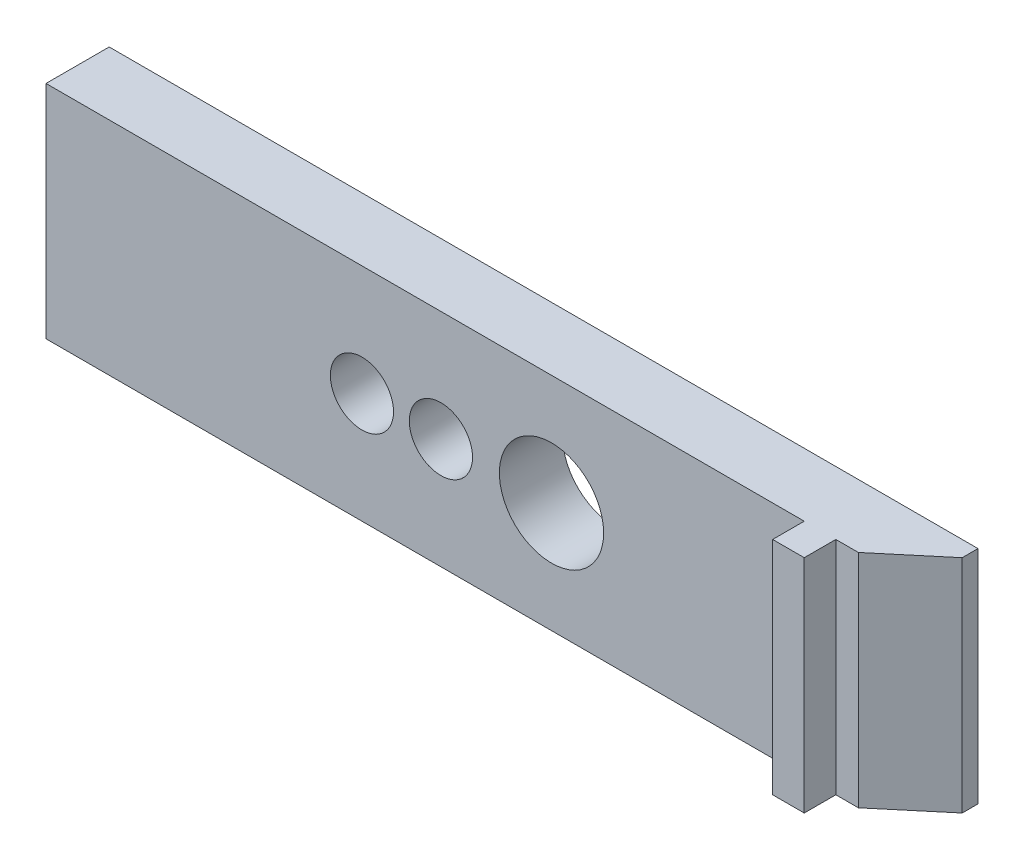
ISO-10303-21;
HEADER;
FILE_DESCRIPTION(('STEP AP214'),'2;1');
FILE_NAME('part.step','',(''),(''),'','','');
FILE_SCHEMA(('AUTOMOTIVE_DESIGN { 1 0 10303 214 1 1 1 1 }'));
ENDSEC;
DATA;
#1=APPLICATION_CONTEXT('core data for automotive mechanical design processes');
#2=APPLICATION_PROTOCOL_DEFINITION('international standard','automotive_design',2000,#1);
#3=PRODUCT_CONTEXT('',#1,'mechanical');
#4=PRODUCT('Part','Part','',(#3));
#5=PRODUCT_RELATED_PRODUCT_CATEGORY('part','',(#4));
#6=PRODUCT_DEFINITION_FORMATION('','',#4);
#7=PRODUCT_DEFINITION_CONTEXT('part definition',#1,'design');
#8=PRODUCT_DEFINITION('design','',#6,#7);
#9=PRODUCT_DEFINITION_SHAPE('','',#8);
#10=(LENGTH_UNIT() NAMED_UNIT(*) SI_UNIT(.MILLI.,.METRE.));
#11=(NAMED_UNIT(*) PLANE_ANGLE_UNIT() SI_UNIT($,.RADIAN.));
#12=(NAMED_UNIT(*) SI_UNIT($,.STERADIAN.) SOLID_ANGLE_UNIT());
#13=UNCERTAINTY_MEASURE_WITH_UNIT(LENGTH_MEASURE(1.E-05),#10,'distance_accuracy_value','');
#14=(GEOMETRIC_REPRESENTATION_CONTEXT(3) GLOBAL_UNCERTAINTY_ASSIGNED_CONTEXT((#13)) GLOBAL_UNIT_ASSIGNED_CONTEXT((#10,
#11,#12)) REPRESENTATION_CONTEXT('',''));
#15=CARTESIAN_POINT('',(0.,0.,0.));
#16=DIRECTION('',(0.,0.,1.));
#17=DIRECTION('',(1.,0.,0.));
#18=AXIS2_PLACEMENT_3D('',#15,#16,#17);
#19=CARTESIAN_POINT('',(0.,0.,2.));
#20=DIRECTION('',(0.,0.,1.));
#21=DIRECTION('',(1.,0.,0.));
#22=AXIS2_PLACEMENT_3D('',#19,#20,#21);
#23=PLANE('',#22);
#24=DIRECTION('',(0.,-1.,0.));
#25=VECTOR('',#24,1.);
#26=CARTESIAN_POINT('',(10.25,-3.5,2.));
#27=LINE('',#26,#25);
#28=CARTESIAN_POINT('',(10.25,3.5,2.));
#29=VERTEX_POINT('',#28);
#30=CARTESIAN_POINT('',(10.25,-3.5,2.));
#31=VERTEX_POINT('',#30);
#32=EDGE_CURVE('E51',#29,#31,#27,.T.);
#33=ORIENTED_EDGE('',*,*,#32,.F.);
#34=DIRECTION('',(-1.,0.,0.));
#35=VECTOR('',#34,1.);
#36=CARTESIAN_POINT('',(-13.75,3.5,2.));
#37=LINE('',#36,#35);
#38=CARTESIAN_POINT('',(-13.75,3.5,2.));
#39=VERTEX_POINT('',#38);
#40=EDGE_CURVE('E157',#29,#39,#37,.T.);
#41=ORIENTED_EDGE('',*,*,#40,.T.);
#42=DIRECTION('',(0.,-1.,0.));
#43=VECTOR('',#42,1.);
#44=CARTESIAN_POINT('',(-13.75,3.5,2.));
#45=LINE('',#44,#43);
#46=CARTESIAN_POINT('',(-13.75,-3.5,2.));
#47=VERTEX_POINT('',#46);
#48=EDGE_CURVE('E156',#39,#47,#45,.T.);
#49=ORIENTED_EDGE('',*,*,#48,.T.);
#50=DIRECTION('',(1.,0.,0.));
#51=VECTOR('',#50,1.);
#52=CARTESIAN_POINT('',(-13.75,-3.5,2.));
#53=LINE('',#52,#51);
#54=EDGE_CURVE('E160',#47,#31,#53,.T.);
#55=ORIENTED_EDGE('',*,*,#54,.T.);
#56=EDGE_LOOP('',(#33,#41,#49,#55));
#57=FACE_BOUND('',#56,.T.);
#58=CARTESIAN_POINT('',(-1.25,0.,2.));
#59=DIRECTION('',(0.,0.,1.));
#60=DIRECTION('',(1.,0.,0.));
#61=AXIS2_PLACEMENT_3D('',#58,#59,#60);
#62=CIRCLE('',#61,1.);
#63=CARTESIAN_POINT('',(-0.249999999999998,0.,2.));
#64=VERTEX_POINT('',#63);
#65=EDGE_CURVE('E142',#64,#64,#62,.T.);
#66=ORIENTED_EDGE('',*,*,#65,.F.);
#67=EDGE_LOOP('',(#66));
#68=FACE_BOUND('',#67,.T.);
#69=CARTESIAN_POINT('',(2.25,0.,2.));
#70=DIRECTION('',(0.,0.,1.));
#71=DIRECTION('',(1.,0.,0.));
#72=AXIS2_PLACEMENT_3D('',#69,#70,#71);
#73=CIRCLE('',#72,1.65);
#74=CARTESIAN_POINT('',(3.9,0.,2.));
#75=VERTEX_POINT('',#74);
#76=EDGE_CURVE('E148',#75,#75,#73,.T.);
#77=ORIENTED_EDGE('',*,*,#76,.F.);
#78=EDGE_LOOP('',(#77));
#79=FACE_BOUND('',#78,.T.);
#80=CARTESIAN_POINT('',(-3.75,0.,2.));
#81=DIRECTION('',(0.,0.,1.));
#82=DIRECTION('',(1.,0.,0.));
#83=AXIS2_PLACEMENT_3D('',#80,#81,#82);
#84=CIRCLE('',#83,1.);
#85=CARTESIAN_POINT('',(-2.75,0.,2.));
#86=VERTEX_POINT('',#85);
#87=EDGE_CURVE('E133',#86,#86,#84,.T.);
#88=ORIENTED_EDGE('',*,*,#87,.F.);
#89=EDGE_LOOP('',(#88));
#90=FACE_BOUND('',#89,.T.);
#91=ADVANCED_FACE('F35',(#57,#68,#79,#90),#23,.T.);
#92=DIRECTION('',(0.,1.,0.));
#93=VECTOR('',#92,1.);
#94=CARTESIAN_POINT('',(11.25,-3.5,2.));
#95=LINE('',#94,#93);
#96=CARTESIAN_POINT('',(11.25,-3.5,2.));
#97=VERTEX_POINT('',#96);
#98=CARTESIAN_POINT('',(11.25,3.5,2.));
#99=VERTEX_POINT('',#98);
#100=EDGE_CURVE('E59',#97,#99,#95,.T.);
#101=ORIENTED_EDGE('',*,*,#100,.F.);
#102=CARTESIAN_POINT('',(11.9623696111087,-3.5,2.));
#103=VERTEX_POINT('',#102);
#104=EDGE_CURVE('E159',#97,#103,#53,.T.);
#105=ORIENTED_EDGE('',*,*,#104,.T.);
#106=DIRECTION('',(0.,1.,0.));
#107=VECTOR('',#106,1.);
#108=CARTESIAN_POINT('',(11.9623696111087,3.5,2.));
#109=LINE('',#108,#107);
#110=CARTESIAN_POINT('',(11.9623696111087,3.5,2.));
#111=VERTEX_POINT('',#110);
#112=EDGE_CURVE('E181',#103,#111,#109,.T.);
#113=ORIENTED_EDGE('',*,*,#112,.T.);
#114=EDGE_CURVE('E154',#111,#99,#37,.T.);
#115=ORIENTED_EDGE('',*,*,#114,.T.);
#116=EDGE_LOOP('',(#101,#105,#113,#115));
#117=FACE_BOUND('',#116,.T.);
#118=ADVANCED_FACE('F195',(#117),#23,.T.);
#119=CARTESIAN_POINT('',(0.,0.,0.));
#120=DIRECTION('',(0.,0.,1.));
#121=DIRECTION('',(1.,0.,0.));
#122=AXIS2_PLACEMENT_3D('',#119,#120,#121);
#123=PLANE('',#122);
#124=DIRECTION('',(0.,1.,0.));
#125=VECTOR('',#124,1.);
#126=CARTESIAN_POINT('',(13.75,3.5,0.));
#127=LINE('',#126,#125);
#128=CARTESIAN_POINT('',(13.75,-3.5,0.));
#129=VERTEX_POINT('',#128);
#130=CARTESIAN_POINT('',(13.75,3.5,0.));
#131=VERTEX_POINT('',#130);
#132=EDGE_CURVE('E151',#129,#131,#127,.T.);
#133=ORIENTED_EDGE('',*,*,#132,.F.);
#134=DIRECTION('',(1.,0.,0.));
#135=VECTOR('',#134,1.);
#136=CARTESIAN_POINT('',(-13.75,-3.5,0.));
#137=LINE('',#136,#135);
#138=CARTESIAN_POINT('',(-13.75,-3.5,0.));
#139=VERTEX_POINT('',#138);
#140=EDGE_CURVE('E169',#139,#129,#137,.T.);
#141=ORIENTED_EDGE('',*,*,#140,.F.);
#142=DIRECTION('',(0.,-1.,0.));
#143=VECTOR('',#142,1.);
#144=CARTESIAN_POINT('',(-13.75,3.5,0.));
#145=LINE('',#144,#143);
#146=CARTESIAN_POINT('',(-13.75,3.5,0.));
#147=VERTEX_POINT('',#146);
#148=EDGE_CURVE('E167',#147,#139,#145,.T.);
#149=ORIENTED_EDGE('',*,*,#148,.F.);
#150=DIRECTION('',(-1.,0.,0.));
#151=VECTOR('',#150,1.);
#152=CARTESIAN_POINT('',(-13.75,3.5,0.));
#153=LINE('',#152,#151);
#154=EDGE_CURVE('E165',#131,#147,#153,.T.);
#155=ORIENTED_EDGE('',*,*,#154,.F.);
#156=EDGE_LOOP('',(#133,#141,#149,#155));
#157=FACE_BOUND('',#156,.T.);
#158=CARTESIAN_POINT('',(2.25,0.,0.));
#159=DIRECTION('',(0.,0.,1.));
#160=DIRECTION('',(1.,0.,0.));
#161=AXIS2_PLACEMENT_3D('',#158,#159,#160);
#162=CIRCLE('',#161,1.65);
#163=CARTESIAN_POINT('',(3.9,0.,0.));
#164=VERTEX_POINT('',#163);
#165=EDGE_CURVE('E145',#164,#164,#162,.T.);
#166=ORIENTED_EDGE('',*,*,#165,.T.);
#167=EDGE_LOOP('',(#166));
#168=FACE_BOUND('',#167,.T.);
#169=CARTESIAN_POINT('',(-1.25,0.,0.));
#170=DIRECTION('',(0.,0.,1.));
#171=DIRECTION('',(1.,0.,0.));
#172=AXIS2_PLACEMENT_3D('',#169,#170,#171);
#173=CIRCLE('',#172,1.);
#174=CARTESIAN_POINT('',(-0.249999999999998,0.,0.));
#175=VERTEX_POINT('',#174);
#176=EDGE_CURVE('E140',#175,#175,#173,.T.);
#177=ORIENTED_EDGE('',*,*,#176,.T.);
#178=EDGE_LOOP('',(#177));
#179=FACE_BOUND('',#178,.T.);
#180=CARTESIAN_POINT('',(-3.75,0.,0.));
#181=DIRECTION('',(0.,0.,1.));
#182=DIRECTION('',(1.,0.,0.));
#183=AXIS2_PLACEMENT_3D('',#180,#181,#182);
#184=CIRCLE('',#183,1.);
#185=CARTESIAN_POINT('',(-2.75,0.,0.));
#186=VERTEX_POINT('',#185);
#187=EDGE_CURVE('E130',#186,#186,#184,.T.);
#188=ORIENTED_EDGE('',*,*,#187,.T.);
#189=EDGE_LOOP('',(#188));
#190=FACE_BOUND('',#189,.T.);
#191=ADVANCED_FACE('F221',(#157,#168,#179,#190),#123,.F.);
#192=CARTESIAN_POINT('',(13.75,3.5,2.));
#193=DIRECTION('',(-1.,0.,0.));
#194=DIRECTION('',(0.,0.,1.));
#195=AXIS2_PLACEMENT_3D('',#192,#193,#194);
#196=PLANE('',#195);
#197=DIRECTION('',(0.,0.,-1.));
#198=VECTOR('',#197,1.);
#199=CARTESIAN_POINT('',(13.75,3.5,2.));
#200=LINE('',#199,#198);
#201=CARTESIAN_POINT('',(13.75,3.5,0.499999999999999));
#202=VERTEX_POINT('',#201);
#203=EDGE_CURVE('E179',#202,#131,#200,.T.);
#204=ORIENTED_EDGE('',*,*,#203,.F.);
#205=DIRECTION('',(0.,-1.,0.));
#206=VECTOR('',#205,1.);
#207=CARTESIAN_POINT('',(13.75,-3.5,0.499999999999999));
#208=LINE('',#207,#206);
#209=CARTESIAN_POINT('',(13.75,-3.5,0.499999999999999));
#210=VERTEX_POINT('',#209);
#211=EDGE_CURVE('E44',#202,#210,#208,.T.);
#212=ORIENTED_EDGE('',*,*,#211,.T.);
#213=DIRECTION('',(0.,0.,-1.));
#214=VECTOR('',#213,1.);
#215=CARTESIAN_POINT('',(13.75,-3.5,2.));
#216=LINE('',#215,#214);
#217=EDGE_CURVE('E162',#210,#129,#216,.T.);
#218=ORIENTED_EDGE('',*,*,#217,.T.);
#219=ORIENTED_EDGE('',*,*,#132,.T.);
#220=EDGE_LOOP('',(#204,#212,#218,#219));
#221=FACE_BOUND('',#220,.T.);
#222=ADVANCED_FACE('F188',(#221),#196,.F.);
#223=CARTESIAN_POINT('',(-13.75,3.5,2.));
#224=DIRECTION('',(0.,-1.,0.));
#225=DIRECTION('',(0.,0.,-1.));
#226=AXIS2_PLACEMENT_3D('',#223,#224,#225);
#227=PLANE('',#226);
#228=ORIENTED_EDGE('',*,*,#114,.F.);
#229=DIRECTION('',(0.766044443118977,0.,-0.64278760968654));
#230=VECTOR('',#229,1.);
#231=CARTESIAN_POINT('',(11.9623696111087,3.5,2.));
#232=LINE('',#231,#230);
#233=EDGE_CURVE('E184',#111,#202,#232,.T.);
#234=ORIENTED_EDGE('',*,*,#233,.T.);
#235=ORIENTED_EDGE('',*,*,#203,.T.);
#236=ORIENTED_EDGE('',*,*,#154,.T.);
#237=DIRECTION('',(0.,0.,-1.));
#238=VECTOR('',#237,1.);
#239=CARTESIAN_POINT('',(-13.75,3.5,2.));
#240=LINE('',#239,#238);
#241=EDGE_CURVE('E176',#39,#147,#240,.T.);
#242=ORIENTED_EDGE('',*,*,#241,.F.);
#243=ORIENTED_EDGE('',*,*,#40,.F.);
#244=DIRECTION('',(0.,0.,-1.));
#245=VECTOR('',#244,1.);
#246=CARTESIAN_POINT('',(10.25,3.5,3.));
#247=LINE('',#246,#245);
#248=CARTESIAN_POINT('',(10.25,3.5,3.));
#249=VERTEX_POINT('',#248);
#250=EDGE_CURVE('E201',#249,#29,#247,.T.);
#251=ORIENTED_EDGE('',*,*,#250,.F.);
#252=DIRECTION('',(-1.,0.,0.));
#253=VECTOR('',#252,1.);
#254=CARTESIAN_POINT('',(11.25,3.5,3.));
#255=LINE('',#254,#253);
#256=CARTESIAN_POINT('',(11.25,3.5,3.));
#257=VERTEX_POINT('',#256);
#258=EDGE_CURVE('E124',#257,#249,#255,.T.);
#259=ORIENTED_EDGE('',*,*,#258,.F.);
#260=DIRECTION('',(0.,0.,-1.));
#261=VECTOR('',#260,1.);
#262=CARTESIAN_POINT('',(11.25,3.5,3.));
#263=LINE('',#262,#261);
#264=EDGE_CURVE('E135',#257,#99,#263,.T.);
#265=ORIENTED_EDGE('',*,*,#264,.T.);
#266=EDGE_LOOP('',(#228,#234,#235,#236,#242,#243,#251,#259,#265));
#267=FACE_BOUND('',#266,.T.);
#268=ADVANCED_FACE('F198',(#267),#227,.F.);
#269=CARTESIAN_POINT('',(-13.75,3.5,2.));
#270=DIRECTION('',(1.,0.,0.));
#271=DIRECTION('',(0.,0.,-1.));
#272=AXIS2_PLACEMENT_3D('',#269,#270,#271);
#273=PLANE('',#272);
#274=ORIENTED_EDGE('',*,*,#148,.T.);
#275=DIRECTION('',(0.,0.,-1.));
#276=VECTOR('',#275,1.);
#277=CARTESIAN_POINT('',(-13.75,-3.5,2.));
#278=LINE('',#277,#276);
#279=EDGE_CURVE('E173',#47,#139,#278,.T.);
#280=ORIENTED_EDGE('',*,*,#279,.F.);
#281=ORIENTED_EDGE('',*,*,#48,.F.);
#282=ORIENTED_EDGE('',*,*,#241,.T.);
#283=EDGE_LOOP('',(#274,#280,#281,#282));
#284=FACE_BOUND('',#283,.T.);
#285=ADVANCED_FACE('F232',(#284),#273,.F.);
#286=CARTESIAN_POINT('',(-13.75,-3.5,2.));
#287=DIRECTION('',(0.,1.,0.));
#288=DIRECTION('',(0.,0.,1.));
#289=AXIS2_PLACEMENT_3D('',#286,#287,#288);
#290=PLANE('',#289);
#291=ORIENTED_EDGE('',*,*,#217,.F.);
#292=DIRECTION('',(-0.766044443118977,0.,0.64278760968654));
#293=VECTOR('',#292,1.);
#294=CARTESIAN_POINT('',(11.9623696111087,-3.5,2.));
#295=LINE('',#294,#293);
#296=EDGE_CURVE('E11',#210,#103,#295,.T.);
#297=ORIENTED_EDGE('',*,*,#296,.T.);
#298=ORIENTED_EDGE('',*,*,#104,.F.);
#299=DIRECTION('',(0.,0.,-1.));
#300=VECTOR('',#299,1.);
#301=CARTESIAN_POINT('',(11.25,-3.5,3.));
#302=LINE('',#301,#300);
#303=CARTESIAN_POINT('',(11.25,-3.5,3.));
#304=VERTEX_POINT('',#303);
#305=EDGE_CURVE('E115',#304,#97,#302,.T.);
#306=ORIENTED_EDGE('',*,*,#305,.F.);
#307=DIRECTION('',(1.,0.,0.));
#308=VECTOR('',#307,1.);
#309=CARTESIAN_POINT('',(11.25,-3.5,3.));
#310=LINE('',#309,#308);
#311=CARTESIAN_POINT('',(10.25,-3.5,3.));
#312=VERTEX_POINT('',#311);
#313=EDGE_CURVE('E107',#312,#304,#310,.T.);
#314=ORIENTED_EDGE('',*,*,#313,.F.);
#315=DIRECTION('',(0.,0.,-1.));
#316=VECTOR('',#315,1.);
#317=CARTESIAN_POINT('',(10.25,-3.5,3.));
#318=LINE('',#317,#316);
#319=EDGE_CURVE('E113',#312,#31,#318,.T.);
#320=ORIENTED_EDGE('',*,*,#319,.T.);
#321=ORIENTED_EDGE('',*,*,#54,.F.);
#322=ORIENTED_EDGE('',*,*,#279,.T.);
#323=ORIENTED_EDGE('',*,*,#140,.T.);
#324=EDGE_LOOP('',(#291,#297,#298,#306,#314,#320,#321,#322,#323));
#325=FACE_BOUND('',#324,.T.);
#326=ADVANCED_FACE('F110',(#325),#290,.F.);
#327=CARTESIAN_POINT('',(2.25,0.,2.));
#328=DIRECTION('',(0.,0.,-1.));
#329=DIRECTION('',(-1.,0.,0.));
#330=AXIS2_PLACEMENT_3D('',#327,#328,#329);
#331=CYLINDRICAL_SURFACE('',#330,1.65);
#332=ORIENTED_EDGE('',*,*,#76,.T.);
#333=EDGE_LOOP('',(#332));
#334=FACE_BOUND('',#333,.T.);
#335=ORIENTED_EDGE('',*,*,#165,.F.);
#336=EDGE_LOOP('',(#335));
#337=FACE_BOUND('',#336,.T.);
#338=ADVANCED_FACE('F225',(#334,#337),#331,.F.);
#339=CARTESIAN_POINT('',(-1.25,0.,2.));
#340=DIRECTION('',(0.,0.,-1.));
#341=DIRECTION('',(-1.,0.,0.));
#342=AXIS2_PLACEMENT_3D('',#339,#340,#341);
#343=CYLINDRICAL_SURFACE('',#342,1.);
#344=ORIENTED_EDGE('',*,*,#65,.T.);
#345=EDGE_LOOP('',(#344));
#346=FACE_BOUND('',#345,.T.);
#347=ORIENTED_EDGE('',*,*,#176,.F.);
#348=EDGE_LOOP('',(#347));
#349=FACE_BOUND('',#348,.T.);
#350=ADVANCED_FACE('F264',(#346,#349),#343,.F.);
#351=CARTESIAN_POINT('',(-3.75,0.,2.));
#352=DIRECTION('',(0.,0.,-1.));
#353=DIRECTION('',(-1.,0.,0.));
#354=AXIS2_PLACEMENT_3D('',#351,#352,#353);
#355=CYLINDRICAL_SURFACE('',#354,1.);
#356=ORIENTED_EDGE('',*,*,#87,.T.);
#357=EDGE_LOOP('',(#356));
#358=FACE_BOUND('',#357,.T.);
#359=ORIENTED_EDGE('',*,*,#187,.F.);
#360=EDGE_LOOP('',(#359));
#361=FACE_BOUND('',#360,.T.);
#362=ADVANCED_FACE('F271',(#358,#361),#355,.F.);
#363=CARTESIAN_POINT('',(11.9623696111087,0.,2.));
#364=DIRECTION('',(0.64278760968654,0.,0.766044443118977));
#365=DIRECTION('',(0.,-1.,0.));
#366=AXIS2_PLACEMENT_3D('',#363,#364,#365);
#367=PLANE('',#366);
#368=ORIENTED_EDGE('',*,*,#296,.F.);
#369=ORIENTED_EDGE('',*,*,#211,.F.);
#370=ORIENTED_EDGE('',*,*,#233,.F.);
#371=ORIENTED_EDGE('',*,*,#112,.F.);
#372=EDGE_LOOP('',(#368,#369,#370,#371));
#373=FACE_BOUND('',#372,.T.);
#374=ADVANCED_FACE('F38',(#373),#367,.T.);
#375=CARTESIAN_POINT('',(10.25,-3.5,3.));
#376=DIRECTION('',(1.,0.,0.));
#377=DIRECTION('',(0.,0.,-1.));
#378=AXIS2_PLACEMENT_3D('',#375,#376,#377);
#379=PLANE('',#378);
#380=ORIENTED_EDGE('',*,*,#32,.T.);
#381=ORIENTED_EDGE('',*,*,#319,.F.);
#382=DIRECTION('',(0.,-1.,0.));
#383=VECTOR('',#382,1.);
#384=CARTESIAN_POINT('',(10.25,-3.5,3.));
#385=LINE('',#384,#383);
#386=EDGE_CURVE('E119',#249,#312,#385,.T.);
#387=ORIENTED_EDGE('',*,*,#386,.F.);
#388=ORIENTED_EDGE('',*,*,#250,.T.);
#389=EDGE_LOOP('',(#380,#381,#387,#388));
#390=FACE_BOUND('',#389,.T.);
#391=ADVANCED_FACE('F129',(#390),#379,.F.);
#392=CARTESIAN_POINT('',(11.25,-3.5,3.));
#393=DIRECTION('',(-1.,0.,0.));
#394=DIRECTION('',(0.,0.,1.));
#395=AXIS2_PLACEMENT_3D('',#392,#393,#394);
#396=PLANE('',#395);
#397=ORIENTED_EDGE('',*,*,#100,.T.);
#398=ORIENTED_EDGE('',*,*,#264,.F.);
#399=DIRECTION('',(0.,1.,0.));
#400=VECTOR('',#399,1.);
#401=CARTESIAN_POINT('',(11.25,-3.5,3.));
#402=LINE('',#401,#400);
#403=EDGE_CURVE('E118',#304,#257,#402,.T.);
#404=ORIENTED_EDGE('',*,*,#403,.F.);
#405=ORIENTED_EDGE('',*,*,#305,.T.);
#406=EDGE_LOOP('',(#397,#398,#404,#405));
#407=FACE_BOUND('',#406,.T.);
#408=ADVANCED_FACE('F207',(#407),#396,.F.);
#409=CARTESIAN_POINT('',(0.,0.,3.));
#410=DIRECTION('',(0.,0.,1.));
#411=DIRECTION('',(1.,0.,0.));
#412=AXIS2_PLACEMENT_3D('',#409,#410,#411);
#413=PLANE('',#412);
#414=ORIENTED_EDGE('',*,*,#386,.T.);
#415=ORIENTED_EDGE('',*,*,#313,.T.);
#416=ORIENTED_EDGE('',*,*,#403,.T.);
#417=ORIENTED_EDGE('',*,*,#258,.T.);
#418=EDGE_LOOP('',(#414,#415,#416,#417));
#419=FACE_BOUND('',#418,.T.);
#420=ADVANCED_FACE('F122',(#419),#413,.T.);
#421=CLOSED_SHELL('',(#91,#118,#191,#222,#268,#285,#326,#338,#350,#362,#374,#391,#408,#420));
#422=MANIFOLD_SOLID_BREP('B2',#421);
#423=ADVANCED_BREP_SHAPE_REPRESENTATION('',(#18,#422),#14);
#424=SHAPE_DEFINITION_REPRESENTATION(#9,#423);
ENDSEC;
END-ISO-10303-21;
